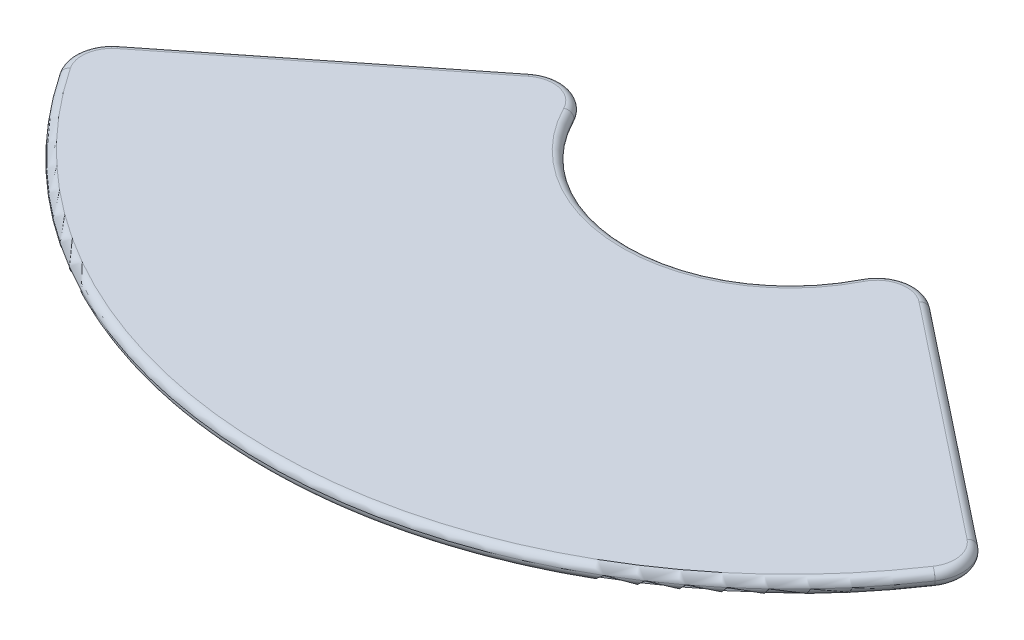
ISO-10303-21;
HEADER;
FILE_DESCRIPTION(('STEP AP214'),'2;1');
FILE_NAME('part.step','',(''),(''),'','','');
FILE_SCHEMA(('AUTOMOTIVE_DESIGN { 1 0 10303 214 1 1 1 1 }'));
ENDSEC;
DATA;
#1=APPLICATION_CONTEXT('core data for automotive mechanical design processes');
#2=APPLICATION_PROTOCOL_DEFINITION('international standard','automotive_design',2000,#1);
#3=PRODUCT_CONTEXT('',#1,'mechanical');
#4=PRODUCT('Part','Part','',(#3));
#5=PRODUCT_RELATED_PRODUCT_CATEGORY('part','',(#4));
#6=PRODUCT_DEFINITION_FORMATION('','',#4);
#7=PRODUCT_DEFINITION_CONTEXT('part definition',#1,'design');
#8=PRODUCT_DEFINITION('design','',#6,#7);
#9=PRODUCT_DEFINITION_SHAPE('','',#8);
#10=(LENGTH_UNIT() NAMED_UNIT(*) SI_UNIT(.MILLI.,.METRE.));
#11=(NAMED_UNIT(*) PLANE_ANGLE_UNIT() SI_UNIT($,.RADIAN.));
#12=(NAMED_UNIT(*) SI_UNIT($,.STERADIAN.) SOLID_ANGLE_UNIT());
#13=UNCERTAINTY_MEASURE_WITH_UNIT(LENGTH_MEASURE(1.E-05),#10,'distance_accuracy_value','');
#14=(GEOMETRIC_REPRESENTATION_CONTEXT(3) GLOBAL_UNCERTAINTY_ASSIGNED_CONTEXT((#13)) GLOBAL_UNIT_ASSIGNED_CONTEXT((#10,
#11,#12)) REPRESENTATION_CONTEXT('',''));
#15=CARTESIAN_POINT('',(0.,0.,0.));
#16=DIRECTION('',(0.,0.,1.));
#17=DIRECTION('',(1.,0.,0.));
#18=AXIS2_PLACEMENT_3D('',#15,#16,#17);
#19=CARTESIAN_POINT('',(-46.9730973484096,56.,-84.0340120939429));
#20=DIRECTION('',(0.,1.,0.));
#21=DIRECTION('',(0.,0.,1.));
#22=AXIS2_PLACEMENT_3D('',#19,#20,#21);
#23=PLANE('',#22);
#24=CARTESIAN_POINT('',(46.9730973484096,56.,-84.0340120939429));
#25=DIRECTION('',(0.,1.,0.));
#26=DIRECTION('',(0.,0.,1.));
#27=AXIS2_PLACEMENT_3D('',#24,#25,#26);
#28=CIRCLE('',#27,8.00000000000001);
#29=CARTESIAN_POINT('',(51.9359088440123,56.,-90.3086038782038));
#30=VERTEX_POINT('',#29);
#31=CARTESIAN_POINT('',(39.8504344147956,56.,-87.6764937663912));
#32=VERTEX_POINT('',#31);
#33=EDGE_CURVE('E44',#30,#32,#28,.T.);
#34=ORIENTED_EDGE('',*,*,#33,.T.);
#35=CARTESIAN_POINT('',(0.,56.,-108.055736522632));
#36=DIRECTION('',(0.,1.,0.));
#37=DIRECTION('',(0.,0.,1.));
#38=AXIS2_PLACEMENT_3D('',#35,#36,#37);
#39=CIRCLE('',#38,44.7590287915826);
#40=CARTESIAN_POINT('',(-39.8504344147956,56.,-87.6764937663912));
#41=VERTEX_POINT('',#40);
#42=EDGE_CURVE('E11',#32,#41,#39,.F.);
#43=ORIENTED_EDGE('',*,*,#42,.T.);
#44=CARTESIAN_POINT('',(-46.9730973484096,56.,-84.0340120939429));
#45=DIRECTION('',(0.,1.,0.));
#46=DIRECTION('',(0.,0.,1.));
#47=AXIS2_PLACEMENT_3D('',#44,#45,#46);
#48=CIRCLE('',#47,8.00000000000001);
#49=CARTESIAN_POINT('',(-51.9359088440123,56.,-90.3086038782038));
#50=VERTEX_POINT('',#49);
#51=EDGE_CURVE('E211',#41,#50,#48,.T.);
#52=ORIENTED_EDGE('',*,*,#51,.T.);
#53=DIRECTION('',(-0.784323973032609,0.,0.620351436950334));
#54=VECTOR('',#53,1.);
#55=CARTESIAN_POINT('',(-112.928801506203,56.,-42.0670227106031));
#56=LINE('',#55,#54);
#57=CARTESIAN_POINT('',(-112.928801506203,56.,-42.0670227106031));
#58=VERTEX_POINT('',#57);
#59=EDGE_CURVE('E209',#50,#58,#56,.T.);
#60=ORIENTED_EDGE('',*,*,#59,.T.);
#61=CARTESIAN_POINT('',(-107.965990010601,56.,-35.7924309263423));
#62=DIRECTION('',(0.,1.,0.));
#63=DIRECTION('',(0.,0.,1.));
#64=AXIS2_PLACEMENT_3D('',#61,#62,#63);
#65=CIRCLE('',#64,7.99999999999999);
#66=CARTESIAN_POINT('',(-114.614253584707,56.,-31.3426453754186));
#67=VERTEX_POINT('',#66);
#68=EDGE_CURVE('E207',#58,#67,#65,.T.);
#69=ORIENTED_EDGE('',*,*,#68,.T.);
#70=CARTESIAN_POINT('',(0.,56.,-108.055736522632));
#71=DIRECTION('',(0.,1.,0.));
#72=DIRECTION('',(0.,0.,1.));
#73=AXIS2_PLACEMENT_3D('',#70,#71,#72);
#74=CIRCLE('',#73,137.917821466771);
#75=CARTESIAN_POINT('',(114.614253584707,56.,-31.3426453754186));
#76=VERTEX_POINT('',#75);
#77=EDGE_CURVE('E135',#67,#76,#74,.T.);
#78=ORIENTED_EDGE('',*,*,#77,.T.);
#79=CARTESIAN_POINT('',(107.965990010601,56.,-35.7924309263423));
#80=DIRECTION('',(0.,1.,0.));
#81=DIRECTION('',(0.,0.,1.));
#82=AXIS2_PLACEMENT_3D('',#79,#80,#81);
#83=CIRCLE('',#82,7.99999999999999);
#84=CARTESIAN_POINT('',(112.928801506203,56.,-42.0670227106031));
#85=VERTEX_POINT('',#84);
#86=EDGE_CURVE('E132',#76,#85,#83,.T.);
#87=ORIENTED_EDGE('',*,*,#86,.T.);
#88=DIRECTION('',(-0.784323973032609,0.,-0.620351436950334));
#89=VECTOR('',#88,1.);
#90=CARTESIAN_POINT('',(51.9359088440123,56.,-90.3086038782038));
#91=LINE('',#90,#89);
#92=EDGE_CURVE('E133',#85,#30,#91,.T.);
#93=ORIENTED_EDGE('',*,*,#92,.T.);
#94=EDGE_LOOP('',(#34,#43,#52,#60,#69,#78,#87,#93));
#95=FACE_BOUND('',#94,.T.);
#96=ADVANCED_FACE('F34',(#95),#23,.T.);
#97=CARTESIAN_POINT('',(-46.9730973484096,52.,-84.0340120939429));
#98=DIRECTION('',(0.,1.,0.));
#99=DIRECTION('',(0.,0.,1.));
#100=AXIS2_PLACEMENT_3D('',#97,#98,#99);
#101=PLANE('',#100);
#102=CARTESIAN_POINT('',(-107.965990010601,52.,-35.7924309263423));
#103=DIRECTION('',(0.,1.,0.));
#104=DIRECTION('',(0.,0.,1.));
#105=AXIS2_PLACEMENT_3D('',#102,#103,#104);
#106=CIRCLE('',#105,7.99999999999999);
#107=CARTESIAN_POINT('',(-114.614253584707,52.,-31.3426453754186));
#108=VERTEX_POINT('',#107);
#109=CARTESIAN_POINT('',(-112.928801506203,52.,-42.0670227106031));
#110=VERTEX_POINT('',#109);
#111=EDGE_CURVE('E216',#108,#110,#106,.F.);
#112=ORIENTED_EDGE('',*,*,#111,.T.);
#113=DIRECTION('',(-0.784323973032609,0.,0.620351436950334));
#114=VECTOR('',#113,1.);
#115=CARTESIAN_POINT('',(-51.9359088440123,52.,-90.3086038782038));
#116=LINE('',#115,#114);
#117=CARTESIAN_POINT('',(-51.9359088440123,52.,-90.3086038782038));
#118=VERTEX_POINT('',#117);
#119=EDGE_CURVE('E213',#110,#118,#116,.F.);
#120=ORIENTED_EDGE('',*,*,#119,.T.);
#121=CARTESIAN_POINT('',(-46.9730973484096,52.,-84.0340120939429));
#122=DIRECTION('',(0.,1.,0.));
#123=DIRECTION('',(0.,0.,1.));
#124=AXIS2_PLACEMENT_3D('',#121,#122,#123);
#125=CIRCLE('',#124,8.00000000000001);
#126=CARTESIAN_POINT('',(-39.8504344147956,52.,-87.6764937663912));
#127=VERTEX_POINT('',#126);
#128=EDGE_CURVE('E146',#118,#127,#125,.F.);
#129=ORIENTED_EDGE('',*,*,#128,.T.);
#130=CARTESIAN_POINT('',(0.,52.,-108.055736522632));
#131=DIRECTION('',(0.,1.,0.));
#132=DIRECTION('',(0.,0.,1.));
#133=AXIS2_PLACEMENT_3D('',#130,#131,#132);
#134=CIRCLE('',#133,44.7590287915826);
#135=CARTESIAN_POINT('',(39.8504344147956,52.,-87.6764937663912));
#136=VERTEX_POINT('',#135);
#137=EDGE_CURVE('E226',#127,#136,#134,.T.);
#138=ORIENTED_EDGE('',*,*,#137,.T.);
#139=CARTESIAN_POINT('',(46.9730973484096,52.,-84.0340120939429));
#140=DIRECTION('',(0.,1.,0.));
#141=DIRECTION('',(0.,0.,1.));
#142=AXIS2_PLACEMENT_3D('',#139,#140,#141);
#143=CIRCLE('',#142,8.00000000000001);
#144=CARTESIAN_POINT('',(51.9359088440123,52.,-90.3086038782038));
#145=VERTEX_POINT('',#144);
#146=EDGE_CURVE('E224',#136,#145,#143,.F.);
#147=ORIENTED_EDGE('',*,*,#146,.T.);
#148=DIRECTION('',(-0.784323973032609,0.,-0.620351436950334));
#149=VECTOR('',#148,1.);
#150=CARTESIAN_POINT('',(-5.85641696469153,52.,-136.018735906312));
#151=LINE('',#150,#149);
#152=CARTESIAN_POINT('',(112.928801506203,52.,-42.0670227106031));
#153=VERTEX_POINT('',#152);
#154=EDGE_CURVE('E222',#145,#153,#151,.F.);
#155=ORIENTED_EDGE('',*,*,#154,.T.);
#156=CARTESIAN_POINT('',(107.965990010601,52.,-35.7924309263423));
#157=DIRECTION('',(0.,1.,0.));
#158=DIRECTION('',(0.,0.,1.));
#159=AXIS2_PLACEMENT_3D('',#156,#157,#158);
#160=CIRCLE('',#159,7.99999999999999);
#161=CARTESIAN_POINT('',(114.614253584707,52.,-31.3426453754186));
#162=VERTEX_POINT('',#161);
#163=EDGE_CURVE('E220',#153,#162,#160,.F.);
#164=ORIENTED_EDGE('',*,*,#163,.T.);
#165=CARTESIAN_POINT('',(0.,52.,-108.055736522632));
#166=DIRECTION('',(0.,1.,0.));
#167=DIRECTION('',(0.,0.,1.));
#168=AXIS2_PLACEMENT_3D('',#165,#166,#167);
#169=CIRCLE('',#168,137.917821466771);
#170=EDGE_CURVE('E218',#162,#108,#169,.F.);
#171=ORIENTED_EDGE('',*,*,#170,.T.);
#172=EDGE_LOOP('',(#112,#120,#129,#138,#147,#155,#164,#171));
#173=FACE_BOUND('',#172,.T.);
#174=ADVANCED_FACE('F230',(#173),#101,.F.);
#175=CARTESIAN_POINT('',(-5.85641696469154,54.,-136.018735906312));
#176=DIRECTION('',(0.784323973032609,0.,0.620351436950334));
#177=DIRECTION('',(0.620351436950334,0.,-0.784323973032609));
#178=AXIS2_PLACEMENT_3D('',#175,#176,#177);
#179=CYLINDRICAL_SURFACE('',#178,2.);
#180=CARTESIAN_POINT('',(51.9359088440123,54.,-90.3086038782038));
#181=DIRECTION('',(-0.78432397303261,0.,-0.620351436950332));
#182=DIRECTION('',(-0.620351436950332,0.,0.78432397303261));
#183=AXIS2_PLACEMENT_3D('',#180,#181,#182);
#184=CIRCLE('',#183,2.);
#185=CARTESIAN_POINT('',(53.1766117179129,54.,-91.877251824269));
#186=VERTEX_POINT('',#185);
#187=EDGE_CURVE('E38',#30,#186,#184,.T.);
#188=ORIENTED_EDGE('',*,*,#187,.F.);
#189=ORIENTED_EDGE('',*,*,#92,.F.);
#190=CARTESIAN_POINT('',(112.928801506203,54.,-42.0670227106031));
#191=DIRECTION('',(0.784323973032608,0.,0.620351436950334));
#192=DIRECTION('',(0.620351436950334,0.,-0.784323973032608));
#193=AXIS2_PLACEMENT_3D('',#190,#191,#192);
#194=CIRCLE('',#193,2.);
#195=CARTESIAN_POINT('',(114.169504380104,54.,-43.6356706566683));
#196=VERTEX_POINT('',#195);
#197=EDGE_CURVE('E80',#196,#85,#194,.T.);
#198=ORIENTED_EDGE('',*,*,#197,.F.);
#199=DIRECTION('',(-0.784323973032609,0.,-0.620351436950334));
#200=VECTOR('',#199,1.);
#201=CARTESIAN_POINT('',(114.169504380104,54.,-43.6356706566683));
#202=LINE('',#201,#200);
#203=EDGE_CURVE('E145',#186,#196,#202,.F.);
#204=ORIENTED_EDGE('',*,*,#203,.F.);
#205=EDGE_LOOP('',(#188,#189,#198,#204));
#206=FACE_BOUND('',#205,.T.);
#207=ADVANCED_FACE('F36',(#206),#179,.T.);
#208=CARTESIAN_POINT('',(46.9730973484096,54.,-84.0340120939429));
#209=DIRECTION('',(0.,1.,0.));
#210=DIRECTION('',(0.,0.,1.));
#211=AXIS2_PLACEMENT_3D('',#208,#209,#210);
#212=TOROIDAL_SURFACE('',#211,8.00000000000001,2.);
#213=ORIENTED_EDGE('',*,*,#33,.F.);
#214=ORIENTED_EDGE('',*,*,#187,.T.);
#215=CARTESIAN_POINT('',(46.9730973484096,54.,-84.0340120939429));
#216=DIRECTION('',(0.,1.,0.));
#217=DIRECTION('',(0.,0.,1.));
#218=AXIS2_PLACEMENT_3D('',#215,#216,#217);
#219=CIRCLE('',#218,10.);
#220=CARTESIAN_POINT('',(38.0697686813921,54.,-88.5871141845033));
#221=VERTEX_POINT('',#220);
#222=EDGE_CURVE('E152',#221,#186,#219,.F.);
#223=ORIENTED_EDGE('',*,*,#222,.F.);
#224=CARTESIAN_POINT('',(39.8504344147956,54.,-87.6764937663912));
#225=DIRECTION('',(-0.455310209056037,0.,0.890332866701746));
#226=DIRECTION('',(0.890332866701746,0.,0.455310209056037));
#227=AXIS2_PLACEMENT_3D('',#224,#225,#226);
#228=CIRCLE('',#227,2.);
#229=EDGE_CURVE('E155',#32,#221,#228,.T.);
#230=ORIENTED_EDGE('',*,*,#229,.F.);
#231=EDGE_LOOP('',(#213,#214,#223,#230));
#232=FACE_BOUND('',#231,.T.);
#233=ADVANCED_FACE('F269',(#232),#212,.T.);
#234=CARTESIAN_POINT('',(107.965990010601,54.,-35.7924309263423));
#235=DIRECTION('',(0.,1.,0.));
#236=DIRECTION('',(0.,0.,1.));
#237=AXIS2_PLACEMENT_3D('',#234,#235,#236);
#238=TOROIDAL_SURFACE('',#237,7.99999999999999,2.);
#239=ORIENTED_EDGE('',*,*,#197,.T.);
#240=ORIENTED_EDGE('',*,*,#86,.F.);
#241=CARTESIAN_POINT('',(114.614253584707,54.,-31.3426453754186));
#242=DIRECTION('',(-0.556223193865457,0.,0.83103294676331));
#243=DIRECTION('',(0.83103294676331,0.,0.556223193865457));
#244=AXIS2_PLACEMENT_3D('',#241,#242,#243);
#245=CIRCLE('',#244,2.);
#246=CARTESIAN_POINT('',(116.276319478234,54.,-30.2301989876877));
#247=VERTEX_POINT('',#246);
#248=EDGE_CURVE('E158',#247,#76,#245,.T.);
#249=ORIENTED_EDGE('',*,*,#248,.F.);
#250=CARTESIAN_POINT('',(107.965990010601,54.,-35.7924309263423));
#251=DIRECTION('',(0.,1.,0.));
#252=DIRECTION('',(0.,0.,1.));
#253=AXIS2_PLACEMENT_3D('',#250,#251,#252);
#254=CIRCLE('',#253,9.99999999999999);
#255=EDGE_CURVE('E143',#196,#247,#254,.F.);
#256=ORIENTED_EDGE('',*,*,#255,.F.);
#257=EDGE_LOOP('',(#239,#240,#249,#256));
#258=FACE_BOUND('',#257,.T.);
#259=ADVANCED_FACE('F141',(#258),#238,.T.);
#260=CARTESIAN_POINT('',(51.9359088440123,54.,-90.3086038782038));
#261=DIRECTION('',(-0.784323973032609,0.,-0.620351436950334));
#262=DIRECTION('',(-0.620351436950334,0.,0.784323973032609));
#263=AXIS2_PLACEMENT_3D('',#260,#261,#262);
#264=CYLINDRICAL_SURFACE('',#263,2.);
#265=CARTESIAN_POINT('',(112.928801506203,54.,-42.0670227106031));
#266=DIRECTION('',(0.78432397303261,0.,0.620351436950332));
#267=DIRECTION('',(0.620351436950332,0.,-0.78432397303261));
#268=AXIS2_PLACEMENT_3D('',#265,#266,#267);
#269=CIRCLE('',#268,2.);
#270=EDGE_CURVE('E161',#153,#196,#269,.T.);
#271=ORIENTED_EDGE('',*,*,#270,.F.);
#272=ORIENTED_EDGE('',*,*,#154,.F.);
#273=CARTESIAN_POINT('',(51.9359088440123,54.,-90.3086038782038));
#274=DIRECTION('',(-0.784323973032608,0.,-0.620351436950334));
#275=DIRECTION('',(-0.620351436950334,0.,0.784323973032608));
#276=AXIS2_PLACEMENT_3D('',#273,#274,#275);
#277=CIRCLE('',#276,2.);
#278=EDGE_CURVE('E147',#186,#145,#277,.T.);
#279=ORIENTED_EDGE('',*,*,#278,.F.);
#280=ORIENTED_EDGE('',*,*,#203,.T.);
#281=EDGE_LOOP('',(#271,#272,#279,#280));
#282=FACE_BOUND('',#281,.T.);
#283=ADVANCED_FACE('F265',(#282),#264,.T.);
#284=CARTESIAN_POINT('',(46.9730973484096,54.,-84.0340120939429));
#285=DIRECTION('',(0.,1.,0.));
#286=DIRECTION('',(0.,0.,1.));
#287=AXIS2_PLACEMENT_3D('',#284,#285,#286);
#288=TOROIDAL_SURFACE('',#287,8.00000000000001,2.);
#289=ORIENTED_EDGE('',*,*,#278,.T.);
#290=ORIENTED_EDGE('',*,*,#146,.F.);
#291=CARTESIAN_POINT('',(39.8504344147956,54.,-87.6764937663912));
#292=DIRECTION('',(-0.455310209056037,0.,0.890332866701746));
#293=DIRECTION('',(0.890332866701746,0.,0.455310209056037));
#294=AXIS2_PLACEMENT_3D('',#291,#292,#293);
#295=CIRCLE('',#294,2.);
#296=EDGE_CURVE('E163',#221,#136,#295,.T.);
#297=ORIENTED_EDGE('',*,*,#296,.F.);
#298=ORIENTED_EDGE('',*,*,#222,.T.);
#299=EDGE_LOOP('',(#289,#290,#297,#298));
#300=FACE_BOUND('',#299,.T.);
#301=ADVANCED_FACE('F268',(#300),#288,.T.);
#302=CARTESIAN_POINT('',(0.,54.,-108.055736522632));
#303=DIRECTION('',(0.,1.,0.));
#304=DIRECTION('',(0.,0.,1.));
#305=AXIS2_PLACEMENT_3D('',#302,#303,#304);
#306=TOROIDAL_SURFACE('',#305,44.7590287915826,2.);
#307=ORIENTED_EDGE('',*,*,#42,.F.);
#308=ORIENTED_EDGE('',*,*,#229,.T.);
#309=CARTESIAN_POINT('',(0.,54.,-108.055736522632));
#310=DIRECTION('',(0.,1.,0.));
#311=DIRECTION('',(0.,0.,1.));
#312=AXIS2_PLACEMENT_3D('',#309,#310,#311);
#313=CIRCLE('',#312,42.7590287915826);
#314=CARTESIAN_POINT('',(-38.0697686813921,54.,-88.5871141845033));
#315=VERTEX_POINT('',#314);
#316=EDGE_CURVE('E166',#315,#221,#313,.T.);
#317=ORIENTED_EDGE('',*,*,#316,.F.);
#318=CARTESIAN_POINT('',(-39.8504344147956,54.,-87.6764937663912));
#319=DIRECTION('',(-0.455310209056035,0.,-0.890332866701746));
#320=DIRECTION('',(-0.890332866701746,0.,0.455310209056035));
#321=AXIS2_PLACEMENT_3D('',#318,#319,#320);
#322=CIRCLE('',#321,2.);
#323=EDGE_CURVE('E169',#41,#315,#322,.T.);
#324=ORIENTED_EDGE('',*,*,#323,.F.);
#325=EDGE_LOOP('',(#307,#308,#317,#324));
#326=FACE_BOUND('',#325,.T.);
#327=ADVANCED_FACE('F272',(#326),#306,.T.);
#328=CARTESIAN_POINT('',(0.,54.,-108.055736522632));
#329=DIRECTION('',(0.,1.,0.));
#330=DIRECTION('',(0.,0.,1.));
#331=AXIS2_PLACEMENT_3D('',#328,#329,#330);
#332=TOROIDAL_SURFACE('',#331,137.917821466771,2.);
#333=ORIENTED_EDGE('',*,*,#248,.T.);
#334=ORIENTED_EDGE('',*,*,#77,.F.);
#335=CARTESIAN_POINT('',(-114.614253584707,54.,-31.3426453754186));
#336=DIRECTION('',(-0.556223193865457,0.,-0.83103294676331));
#337=DIRECTION('',(-0.83103294676331,0.,0.556223193865457));
#338=AXIS2_PLACEMENT_3D('',#335,#336,#337);
#339=CIRCLE('',#338,2.);
#340=CARTESIAN_POINT('',(-116.276319478234,54.,-30.2301989876877));
#341=VERTEX_POINT('',#340);
#342=EDGE_CURVE('E172',#341,#67,#339,.T.);
#343=ORIENTED_EDGE('',*,*,#342,.F.);
#344=CARTESIAN_POINT('',(0.,54.,-108.055736522632));
#345=DIRECTION('',(0.,1.,0.));
#346=DIRECTION('',(0.,0.,1.));
#347=AXIS2_PLACEMENT_3D('',#344,#345,#346);
#348=CIRCLE('',#347,139.917821466771);
#349=EDGE_CURVE('E175',#247,#341,#348,.F.);
#350=ORIENTED_EDGE('',*,*,#349,.F.);
#351=EDGE_LOOP('',(#333,#334,#343,#350));
#352=FACE_BOUND('',#351,.T.);
#353=ADVANCED_FACE('F252',(#352),#332,.T.);
#354=CARTESIAN_POINT('',(107.965990010601,54.,-35.7924309263423));
#355=DIRECTION('',(0.,1.,0.));
#356=DIRECTION('',(0.,0.,1.));
#357=AXIS2_PLACEMENT_3D('',#354,#355,#356);
#358=TOROIDAL_SURFACE('',#357,7.99999999999999,2.);
#359=ORIENTED_EDGE('',*,*,#270,.T.);
#360=ORIENTED_EDGE('',*,*,#255,.T.);
#361=CARTESIAN_POINT('',(114.614253584707,54.,-31.3426453754186));
#362=DIRECTION('',(-0.556223193865458,0.,0.831032946763309));
#363=DIRECTION('',(0.831032946763309,0.,0.556223193865458));
#364=AXIS2_PLACEMENT_3D('',#361,#362,#363);
#365=CIRCLE('',#364,2.);
#366=EDGE_CURVE('E178',#162,#247,#365,.T.);
#367=ORIENTED_EDGE('',*,*,#366,.F.);
#368=ORIENTED_EDGE('',*,*,#163,.F.);
#369=EDGE_LOOP('',(#359,#360,#367,#368));
#370=FACE_BOUND('',#369,.T.);
#371=ADVANCED_FACE('F261',(#370),#358,.T.);
#372=CARTESIAN_POINT('',(0.,54.,-108.055736522632));
#373=DIRECTION('',(0.,1.,0.));
#374=DIRECTION('',(0.,0.,1.));
#375=AXIS2_PLACEMENT_3D('',#372,#373,#374);
#376=TOROIDAL_SURFACE('',#375,44.7590287915826,2.);
#377=ORIENTED_EDGE('',*,*,#296,.T.);
#378=ORIENTED_EDGE('',*,*,#137,.F.);
#379=CARTESIAN_POINT('',(-39.8504344147956,54.,-87.6764937663912));
#380=DIRECTION('',(-0.455310209056038,0.,-0.890332866701745));
#381=DIRECTION('',(-0.890332866701745,0.,0.455310209056038));
#382=AXIS2_PLACEMENT_3D('',#379,#380,#381);
#383=CIRCLE('',#382,2.);
#384=EDGE_CURVE('E181',#315,#127,#383,.T.);
#385=ORIENTED_EDGE('',*,*,#384,.F.);
#386=ORIENTED_EDGE('',*,*,#316,.T.);
#387=EDGE_LOOP('',(#377,#378,#385,#386));
#388=FACE_BOUND('',#387,.T.);
#389=ADVANCED_FACE('F235',(#388),#376,.T.);
#390=CARTESIAN_POINT('',(-46.9730973484096,54.,-84.0340120939429));
#391=DIRECTION('',(0.,1.,0.));
#392=DIRECTION('',(0.,0.,1.));
#393=AXIS2_PLACEMENT_3D('',#390,#391,#392);
#394=TOROIDAL_SURFACE('',#393,8.00000000000001,2.);
#395=ORIENTED_EDGE('',*,*,#51,.F.);
#396=ORIENTED_EDGE('',*,*,#323,.T.);
#397=CARTESIAN_POINT('',(-46.9730973484096,54.,-84.0340120939429));
#398=DIRECTION('',(0.,1.,0.));
#399=DIRECTION('',(0.,0.,1.));
#400=AXIS2_PLACEMENT_3D('',#397,#398,#399);
#401=CIRCLE('',#400,10.);
#402=CARTESIAN_POINT('',(-53.1766117179129,54.,-91.877251824269));
#403=VERTEX_POINT('',#402);
#404=EDGE_CURVE('E184',#403,#315,#401,.F.);
#405=ORIENTED_EDGE('',*,*,#404,.F.);
#406=CARTESIAN_POINT('',(-51.9359088440123,54.,-90.3086038782038));
#407=DIRECTION('',(-0.784323973032608,0.,0.620351436950334));
#408=DIRECTION('',(0.620351436950334,0.,0.784323973032608));
#409=AXIS2_PLACEMENT_3D('',#406,#407,#408);
#410=CIRCLE('',#409,2.);
#411=EDGE_CURVE('E187',#50,#403,#410,.T.);
#412=ORIENTED_EDGE('',*,*,#411,.F.);
#413=EDGE_LOOP('',(#395,#396,#405,#412));
#414=FACE_BOUND('',#413,.T.);
#415=ADVANCED_FACE('F240',(#414),#394,.T.);
#416=CARTESIAN_POINT('',(-107.965990010601,54.,-35.7924309263423));
#417=DIRECTION('',(0.,1.,0.));
#418=DIRECTION('',(0.,0.,1.));
#419=AXIS2_PLACEMENT_3D('',#416,#417,#418);
#420=TOROIDAL_SURFACE('',#419,7.99999999999999,2.);
#421=ORIENTED_EDGE('',*,*,#342,.T.);
#422=ORIENTED_EDGE('',*,*,#68,.F.);
#423=CARTESIAN_POINT('',(-112.928801506203,54.,-42.0670227106031));
#424=DIRECTION('',(0.784323973032608,0.,-0.620351436950334));
#425=DIRECTION('',(-0.620351436950334,0.,-0.784323973032608));
#426=AXIS2_PLACEMENT_3D('',#423,#424,#425);
#427=CIRCLE('',#426,2.);
#428=CARTESIAN_POINT('',(-114.169504380104,54.,-43.6356706566683));
#429=VERTEX_POINT('',#428);
#430=EDGE_CURVE('E190',#429,#58,#427,.T.);
#431=ORIENTED_EDGE('',*,*,#430,.F.);
#432=CARTESIAN_POINT('',(-107.965990010601,54.,-35.7924309263423));
#433=DIRECTION('',(0.,1.,0.));
#434=DIRECTION('',(0.,0.,1.));
#435=AXIS2_PLACEMENT_3D('',#432,#433,#434);
#436=CIRCLE('',#435,9.99999999999999);
#437=EDGE_CURVE('E193',#341,#429,#436,.F.);
#438=ORIENTED_EDGE('',*,*,#437,.F.);
#439=EDGE_LOOP('',(#421,#422,#431,#438));
#440=FACE_BOUND('',#439,.T.);
#441=ADVANCED_FACE('F248',(#440),#420,.T.);
#442=CARTESIAN_POINT('',(0.,54.,-108.055736522632));
#443=DIRECTION('',(0.,1.,0.));
#444=DIRECTION('',(0.,0.,1.));
#445=AXIS2_PLACEMENT_3D('',#442,#443,#444);
#446=TOROIDAL_SURFACE('',#445,137.917821466771,2.);
#447=ORIENTED_EDGE('',*,*,#366,.T.);
#448=ORIENTED_EDGE('',*,*,#349,.T.);
#449=CARTESIAN_POINT('',(-114.614253584707,54.,-31.3426453754186));
#450=DIRECTION('',(-0.55622319386546,0.,-0.831032946763308));
#451=DIRECTION('',(-0.831032946763308,0.,0.55622319386546));
#452=AXIS2_PLACEMENT_3D('',#449,#450,#451);
#453=CIRCLE('',#452,2.);
#454=EDGE_CURVE('E196',#108,#341,#453,.T.);
#455=ORIENTED_EDGE('',*,*,#454,.F.);
#456=ORIENTED_EDGE('',*,*,#170,.F.);
#457=EDGE_LOOP('',(#447,#448,#455,#456));
#458=FACE_BOUND('',#457,.T.);
#459=ADVANCED_FACE('F255',(#458),#446,.T.);
#460=CARTESIAN_POINT('',(-46.9730973484096,54.,-84.0340120939429));
#461=DIRECTION('',(0.,1.,0.));
#462=DIRECTION('',(0.,0.,1.));
#463=AXIS2_PLACEMENT_3D('',#460,#461,#462);
#464=TOROIDAL_SURFACE('',#463,8.00000000000001,2.);
#465=ORIENTED_EDGE('',*,*,#384,.T.);
#466=ORIENTED_EDGE('',*,*,#128,.F.);
#467=CARTESIAN_POINT('',(-51.9359088440123,54.,-90.3086038782038));
#468=DIRECTION('',(-0.784323973032608,0.,0.620351436950334));
#469=DIRECTION('',(0.620351436950334,0.,0.784323973032608));
#470=AXIS2_PLACEMENT_3D('',#467,#468,#469);
#471=CIRCLE('',#470,2.);
#472=EDGE_CURVE('E93',#403,#118,#471,.T.);
#473=ORIENTED_EDGE('',*,*,#472,.F.);
#474=ORIENTED_EDGE('',*,*,#404,.T.);
#475=EDGE_LOOP('',(#465,#466,#473,#474));
#476=FACE_BOUND('',#475,.T.);
#477=ADVANCED_FACE('F237',(#476),#464,.T.);
#478=CARTESIAN_POINT('',(-51.9359088440123,54.,-90.3086038782038));
#479=DIRECTION('',(0.784323973032609,0.,-0.620351436950334));
#480=DIRECTION('',(-0.620351436950334,0.,-0.784323973032609));
#481=AXIS2_PLACEMENT_3D('',#478,#479,#480);
#482=CYLINDRICAL_SURFACE('',#481,2.);
#483=ORIENTED_EDGE('',*,*,#59,.F.);
#484=ORIENTED_EDGE('',*,*,#411,.T.);
#485=DIRECTION('',(-0.784323973032609,0.,0.620351436950334));
#486=VECTOR('',#485,1.);
#487=CARTESIAN_POINT('',(-53.1766117179129,54.,-91.877251824269));
#488=LINE('',#487,#486);
#489=EDGE_CURVE('E200',#429,#403,#488,.F.);
#490=ORIENTED_EDGE('',*,*,#489,.F.);
#491=ORIENTED_EDGE('',*,*,#430,.T.);
#492=EDGE_LOOP('',(#483,#484,#490,#491));
#493=FACE_BOUND('',#492,.T.);
#494=ADVANCED_FACE('F245',(#493),#482,.T.);
#495=CARTESIAN_POINT('',(-107.965990010601,54.,-35.7924309263423));
#496=DIRECTION('',(0.,1.,0.));
#497=DIRECTION('',(0.,0.,1.));
#498=AXIS2_PLACEMENT_3D('',#495,#496,#497);
#499=TOROIDAL_SURFACE('',#498,7.99999999999999,2.);
#500=ORIENTED_EDGE('',*,*,#454,.T.);
#501=ORIENTED_EDGE('',*,*,#437,.T.);
#502=CARTESIAN_POINT('',(-112.928801506203,54.,-42.0670227106031));
#503=DIRECTION('',(0.784323973032608,0.,-0.620351436950334));
#504=DIRECTION('',(-0.620351436950334,0.,-0.784323973032608));
#505=AXIS2_PLACEMENT_3D('',#502,#503,#504);
#506=CIRCLE('',#505,2.);
#507=EDGE_CURVE('E202',#110,#429,#506,.T.);
#508=ORIENTED_EDGE('',*,*,#507,.F.);
#509=ORIENTED_EDGE('',*,*,#111,.F.);
#510=EDGE_LOOP('',(#500,#501,#508,#509));
#511=FACE_BOUND('',#510,.T.);
#512=ADVANCED_FACE('F291',(#511),#499,.T.);
#513=CARTESIAN_POINT('',(-51.9359088440123,54.,-90.3086038782038));
#514=DIRECTION('',(-0.784323973032609,0.,0.620351436950334));
#515=DIRECTION('',(0.620351436950334,0.,0.784323973032609));
#516=AXIS2_PLACEMENT_3D('',#513,#514,#515);
#517=CYLINDRICAL_SURFACE('',#516,2.);
#518=ORIENTED_EDGE('',*,*,#472,.T.);
#519=ORIENTED_EDGE('',*,*,#119,.F.);
#520=ORIENTED_EDGE('',*,*,#507,.T.);
#521=ORIENTED_EDGE('',*,*,#489,.T.);
#522=EDGE_LOOP('',(#518,#519,#520,#521));
#523=FACE_BOUND('',#522,.T.);
#524=ADVANCED_FACE('F288',(#523),#517,.T.);
#525=CLOSED_SHELL('',(#96,#174,#207,#233,#259,#283,#301,#327,#353,#371,#389,#415,#441,#459,#477,
#494,#512,#524));
#526=MANIFOLD_SOLID_BREP('B2',#525);
#527=ADVANCED_BREP_SHAPE_REPRESENTATION('',(#18,#526),#14);
#528=SHAPE_DEFINITION_REPRESENTATION(#9,#527);
ENDSEC;
END-ISO-10303-21;
